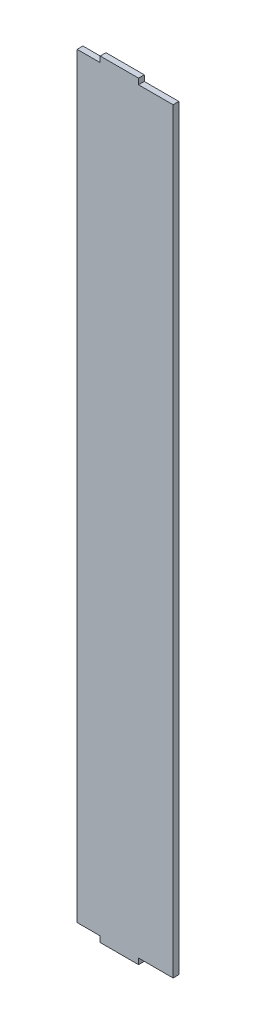
ISO-10303-21;
HEADER;
FILE_DESCRIPTION(('STEP AP214'),'2;1');
FILE_NAME('part.step','',(''),(''),'','','');
FILE_SCHEMA(('AUTOMOTIVE_DESIGN { 1 0 10303 214 1 1 1 1 }'));
ENDSEC;
DATA;
#1=APPLICATION_CONTEXT('core data for automotive mechanical design processes');
#2=APPLICATION_PROTOCOL_DEFINITION('international standard','automotive_design',2000,#1);
#3=PRODUCT_CONTEXT('',#1,'mechanical');
#4=PRODUCT('Part','Part','',(#3));
#5=PRODUCT_RELATED_PRODUCT_CATEGORY('part','',(#4));
#6=PRODUCT_DEFINITION_FORMATION('','',#4);
#7=PRODUCT_DEFINITION_CONTEXT('part definition',#1,'design');
#8=PRODUCT_DEFINITION('design','',#6,#7);
#9=PRODUCT_DEFINITION_SHAPE('','',#8);
#10=(LENGTH_UNIT() NAMED_UNIT(*) SI_UNIT(.MILLI.,.METRE.));
#11=(NAMED_UNIT(*) PLANE_ANGLE_UNIT() SI_UNIT($,.RADIAN.));
#12=(NAMED_UNIT(*) SI_UNIT($,.STERADIAN.) SOLID_ANGLE_UNIT());
#13=UNCERTAINTY_MEASURE_WITH_UNIT(LENGTH_MEASURE(1.E-05),#10,'distance_accuracy_value','');
#14=(GEOMETRIC_REPRESENTATION_CONTEXT(3) GLOBAL_UNCERTAINTY_ASSIGNED_CONTEXT((#13)) GLOBAL_UNIT_ASSIGNED_CONTEXT((#10,
#11,#12)) REPRESENTATION_CONTEXT('',''));
#15=CARTESIAN_POINT('',(0.,0.,0.));
#16=DIRECTION('',(0.,0.,1.));
#17=DIRECTION('',(1.,0.,0.));
#18=AXIS2_PLACEMENT_3D('',#15,#16,#17);
#19=CARTESIAN_POINT('',(32.,0.,3.));
#20=DIRECTION('',(-1.,0.,0.));
#21=DIRECTION('',(0.,0.,1.));
#22=AXIS2_PLACEMENT_3D('',#19,#20,#21);
#23=PLANE('',#22);
#24=DIRECTION('',(0.,1.,0.));
#25=VECTOR('',#24,1.);
#26=CARTESIAN_POINT('',(32.,0.,0.));
#27=LINE('',#26,#25);
#28=CARTESIAN_POINT('',(32.,-3.,0.));
#29=VERTEX_POINT('',#28);
#30=CARTESIAN_POINT('',(32.,0.,0.));
#31=VERTEX_POINT('',#30);
#32=EDGE_CURVE('E156',#29,#31,#27,.T.);
#33=ORIENTED_EDGE('',*,*,#32,.T.);
#34=DIRECTION('',(0.,0.,-1.));
#35=VECTOR('',#34,1.);
#36=CARTESIAN_POINT('',(32.,0.,3.));
#37=LINE('',#36,#35);
#38=CARTESIAN_POINT('',(32.,0.,3.));
#39=VERTEX_POINT('',#38);
#40=EDGE_CURVE('E11',#39,#31,#37,.T.);
#41=ORIENTED_EDGE('',*,*,#40,.F.);
#42=DIRECTION('',(0.,1.,0.));
#43=VECTOR('',#42,1.);
#44=CARTESIAN_POINT('',(32.,0.,3.));
#45=LINE('',#44,#43);
#46=CARTESIAN_POINT('',(32.,-3.,3.));
#47=VERTEX_POINT('',#46);
#48=EDGE_CURVE('E183',#47,#39,#45,.T.);
#49=ORIENTED_EDGE('',*,*,#48,.F.);
#50=DIRECTION('',(0.,0.,-1.));
#51=VECTOR('',#50,1.);
#52=CARTESIAN_POINT('',(32.,-3.,3.));
#53=LINE('',#52,#51);
#54=EDGE_CURVE('E152',#47,#29,#53,.T.);
#55=ORIENTED_EDGE('',*,*,#54,.T.);
#56=EDGE_LOOP('',(#33,#41,#49,#55));
#57=FACE_BOUND('',#56,.T.);
#58=ADVANCED_FACE('F35',(#57),#23,.F.);
#59=CARTESIAN_POINT('',(0.,0.,3.));
#60=DIRECTION('',(0.,1.,0.));
#61=DIRECTION('',(0.,0.,1.));
#62=AXIS2_PLACEMENT_3D('',#59,#60,#61);
#63=PLANE('',#62);
#64=DIRECTION('',(1.,0.,0.));
#65=VECTOR('',#64,1.);
#66=CARTESIAN_POINT('',(0.,0.,0.));
#67=LINE('',#66,#65);
#68=CARTESIAN_POINT('',(50.,0.,0.));
#69=VERTEX_POINT('',#68);
#70=EDGE_CURVE('E159',#31,#69,#67,.T.);
#71=ORIENTED_EDGE('',*,*,#70,.T.);
#72=DIRECTION('',(0.,0.,-1.));
#73=VECTOR('',#72,1.);
#74=CARTESIAN_POINT('',(50.,0.,3.));
#75=LINE('',#74,#73);
#76=CARTESIAN_POINT('',(50.,0.,3.));
#77=VERTEX_POINT('',#76);
#78=EDGE_CURVE('E43',#77,#69,#75,.T.);
#79=ORIENTED_EDGE('',*,*,#78,.F.);
#80=DIRECTION('',(1.,0.,0.));
#81=VECTOR('',#80,1.);
#82=CARTESIAN_POINT('',(0.,0.,3.));
#83=LINE('',#82,#81);
#84=EDGE_CURVE('E106',#39,#77,#83,.T.);
#85=ORIENTED_EDGE('',*,*,#84,.F.);
#86=ORIENTED_EDGE('',*,*,#40,.T.);
#87=EDGE_LOOP('',(#71,#79,#85,#86));
#88=FACE_BOUND('',#87,.T.);
#89=ADVANCED_FACE('F253',(#88),#63,.F.);
#90=CARTESIAN_POINT('',(50.,0.,3.));
#91=DIRECTION('',(-1.,0.,0.));
#92=DIRECTION('',(0.,-1.,0.));
#93=AXIS2_PLACEMENT_3D('',#90,#91,#92);
#94=PLANE('',#93);
#95=DIRECTION('',(0.,1.,0.));
#96=VECTOR('',#95,1.);
#97=CARTESIAN_POINT('',(50.,0.,0.));
#98=LINE('',#97,#96);
#99=CARTESIAN_POINT('',(50.,394.,0.));
#100=VERTEX_POINT('',#99);
#101=EDGE_CURVE('E161',#69,#100,#98,.T.);
#102=ORIENTED_EDGE('',*,*,#101,.T.);
#103=DIRECTION('',(0.,0.,-1.));
#104=VECTOR('',#103,1.);
#105=CARTESIAN_POINT('',(50.,394.,3.));
#106=LINE('',#105,#104);
#107=CARTESIAN_POINT('',(50.,394.,3.));
#108=VERTEX_POINT('',#107);
#109=EDGE_CURVE('E197',#108,#100,#106,.T.);
#110=ORIENTED_EDGE('',*,*,#109,.F.);
#111=DIRECTION('',(0.,1.,0.));
#112=VECTOR('',#111,1.);
#113=CARTESIAN_POINT('',(50.,0.,3.));
#114=LINE('',#113,#112);
#115=EDGE_CURVE('E205',#77,#108,#114,.T.);
#116=ORIENTED_EDGE('',*,*,#115,.F.);
#117=ORIENTED_EDGE('',*,*,#78,.T.);
#118=EDGE_LOOP('',(#102,#110,#116,#117));
#119=FACE_BOUND('',#118,.T.);
#120=ADVANCED_FACE('F203',(#119),#94,.F.);
#121=CARTESIAN_POINT('',(0.,394.,3.));
#122=DIRECTION('',(0.,-1.,0.));
#123=DIRECTION('',(0.,0.,-1.));
#124=AXIS2_PLACEMENT_3D('',#121,#122,#123);
#125=PLANE('',#124);
#126=DIRECTION('',(-1.,0.,0.));
#127=VECTOR('',#126,1.);
#128=CARTESIAN_POINT('',(0.,394.,0.));
#129=LINE('',#128,#127);
#130=CARTESIAN_POINT('',(32.,394.,0.));
#131=VERTEX_POINT('',#130);
#132=EDGE_CURVE('E163',#100,#131,#129,.T.);
#133=ORIENTED_EDGE('',*,*,#132,.T.);
#134=DIRECTION('',(0.,0.,-1.));
#135=VECTOR('',#134,1.);
#136=CARTESIAN_POINT('',(32.,394.,3.));
#137=LINE('',#136,#135);
#138=CARTESIAN_POINT('',(32.,394.,3.));
#139=VERTEX_POINT('',#138);
#140=EDGE_CURVE('E195',#139,#131,#137,.T.);
#141=ORIENTED_EDGE('',*,*,#140,.F.);
#142=DIRECTION('',(-1.,0.,0.));
#143=VECTOR('',#142,1.);
#144=CARTESIAN_POINT('',(0.,394.,3.));
#145=LINE('',#144,#143);
#146=EDGE_CURVE('E216',#108,#139,#145,.T.);
#147=ORIENTED_EDGE('',*,*,#146,.F.);
#148=ORIENTED_EDGE('',*,*,#109,.T.);
#149=EDGE_LOOP('',(#133,#141,#147,#148));
#150=FACE_BOUND('',#149,.T.);
#151=ADVANCED_FACE('F213',(#150),#125,.F.);
#152=CARTESIAN_POINT('',(32.,0.,3.));
#153=DIRECTION('',(1.,0.,0.));
#154=DIRECTION('',(0.,0.,-1.));
#155=AXIS2_PLACEMENT_3D('',#152,#153,#154);
#156=PLANE('',#155);
#157=DIRECTION('',(0.,-1.,0.));
#158=VECTOR('',#157,1.);
#159=CARTESIAN_POINT('',(32.,0.,0.));
#160=LINE('',#159,#158);
#161=CARTESIAN_POINT('',(32.,397.,0.));
#162=VERTEX_POINT('',#161);
#163=EDGE_CURVE('E166',#162,#131,#160,.T.);
#164=ORIENTED_EDGE('',*,*,#163,.F.);
#165=DIRECTION('',(0.,0.,-1.));
#166=VECTOR('',#165,1.);
#167=CARTESIAN_POINT('',(32.,397.,3.));
#168=LINE('',#167,#166);
#169=CARTESIAN_POINT('',(32.,397.,3.));
#170=VERTEX_POINT('',#169);
#171=EDGE_CURVE('E193',#170,#162,#168,.T.);
#172=ORIENTED_EDGE('',*,*,#171,.F.);
#173=DIRECTION('',(0.,-1.,0.));
#174=VECTOR('',#173,1.);
#175=CARTESIAN_POINT('',(32.,0.,3.));
#176=LINE('',#175,#174);
#177=EDGE_CURVE('E218',#170,#139,#176,.T.);
#178=ORIENTED_EDGE('',*,*,#177,.T.);
#179=ORIENTED_EDGE('',*,*,#140,.T.);
#180=EDGE_LOOP('',(#164,#172,#178,#179));
#181=FACE_BOUND('',#180,.T.);
#182=ADVANCED_FACE('F322',(#181),#156,.T.);
#183=CARTESIAN_POINT('',(0.,397.,3.));
#184=DIRECTION('',(0.,1.,0.));
#185=DIRECTION('',(0.,0.,1.));
#186=AXIS2_PLACEMENT_3D('',#183,#184,#185);
#187=PLANE('',#186);
#188=DIRECTION('',(1.,0.,0.));
#189=VECTOR('',#188,1.);
#190=CARTESIAN_POINT('',(0.,397.,0.));
#191=LINE('',#190,#189);
#192=CARTESIAN_POINT('',(12.,397.,0.));
#193=VERTEX_POINT('',#192);
#194=EDGE_CURVE('E169',#193,#162,#191,.T.);
#195=ORIENTED_EDGE('',*,*,#194,.F.);
#196=DIRECTION('',(0.,0.,-1.));
#197=VECTOR('',#196,1.);
#198=CARTESIAN_POINT('',(12.,397.,3.));
#199=LINE('',#198,#197);
#200=CARTESIAN_POINT('',(12.,397.,3.));
#201=VERTEX_POINT('',#200);
#202=EDGE_CURVE('E191',#201,#193,#199,.T.);
#203=ORIENTED_EDGE('',*,*,#202,.F.);
#204=DIRECTION('',(1.,0.,0.));
#205=VECTOR('',#204,1.);
#206=CARTESIAN_POINT('',(0.,397.,3.));
#207=LINE('',#206,#205);
#208=EDGE_CURVE('E220',#201,#170,#207,.T.);
#209=ORIENTED_EDGE('',*,*,#208,.T.);
#210=ORIENTED_EDGE('',*,*,#171,.T.);
#211=EDGE_LOOP('',(#195,#203,#209,#210));
#212=FACE_BOUND('',#211,.T.);
#213=ADVANCED_FACE('F313',(#212),#187,.T.);
#214=CARTESIAN_POINT('',(12.,0.,3.));
#215=DIRECTION('',(-1.,0.,0.));
#216=DIRECTION('',(0.,0.,1.));
#217=AXIS2_PLACEMENT_3D('',#214,#215,#216);
#218=PLANE('',#217);
#219=DIRECTION('',(0.,1.,0.));
#220=VECTOR('',#219,1.);
#221=CARTESIAN_POINT('',(12.,0.,0.));
#222=LINE('',#221,#220);
#223=CARTESIAN_POINT('',(12.,394.,0.));
#224=VERTEX_POINT('',#223);
#225=EDGE_CURVE('E172',#224,#193,#222,.T.);
#226=ORIENTED_EDGE('',*,*,#225,.F.);
#227=DIRECTION('',(0.,0.,-1.));
#228=VECTOR('',#227,1.);
#229=CARTESIAN_POINT('',(12.,394.,3.));
#230=LINE('',#229,#228);
#231=CARTESIAN_POINT('',(12.,394.,3.));
#232=VERTEX_POINT('',#231);
#233=EDGE_CURVE('E189',#232,#224,#230,.T.);
#234=ORIENTED_EDGE('',*,*,#233,.F.);
#235=DIRECTION('',(0.,1.,0.));
#236=VECTOR('',#235,1.);
#237=CARTESIAN_POINT('',(12.,0.,3.));
#238=LINE('',#237,#236);
#239=EDGE_CURVE('E227',#232,#201,#238,.T.);
#240=ORIENTED_EDGE('',*,*,#239,.T.);
#241=ORIENTED_EDGE('',*,*,#202,.T.);
#242=EDGE_LOOP('',(#226,#234,#240,#241));
#243=FACE_BOUND('',#242,.T.);
#244=ADVANCED_FACE('F239',(#243),#218,.T.);
#245=CARTESIAN_POINT('',(0.,394.,3.));
#246=DIRECTION('',(0.,1.,0.));
#247=DIRECTION('',(0.,0.,1.));
#248=AXIS2_PLACEMENT_3D('',#245,#246,#247);
#249=PLANE('',#248);
#250=DIRECTION('',(1.,0.,0.));
#251=VECTOR('',#250,1.);
#252=CARTESIAN_POINT('',(0.,394.,0.));
#253=LINE('',#252,#251);
#254=CARTESIAN_POINT('',(0.,394.,0.));
#255=VERTEX_POINT('',#254);
#256=EDGE_CURVE('E175',#255,#224,#253,.T.);
#257=ORIENTED_EDGE('',*,*,#256,.F.);
#258=DIRECTION('',(0.,0.,-1.));
#259=VECTOR('',#258,1.);
#260=CARTESIAN_POINT('',(0.,394.,3.));
#261=LINE('',#260,#259);
#262=CARTESIAN_POINT('',(0.,394.,3.));
#263=VERTEX_POINT('',#262);
#264=EDGE_CURVE('E187',#263,#255,#261,.T.);
#265=ORIENTED_EDGE('',*,*,#264,.F.);
#266=DIRECTION('',(1.,0.,0.));
#267=VECTOR('',#266,1.);
#268=CARTESIAN_POINT('',(0.,394.,3.));
#269=LINE('',#268,#267);
#270=EDGE_CURVE('E230',#263,#232,#269,.T.);
#271=ORIENTED_EDGE('',*,*,#270,.T.);
#272=ORIENTED_EDGE('',*,*,#233,.T.);
#273=EDGE_LOOP('',(#257,#265,#271,#272));
#274=FACE_BOUND('',#273,.T.);
#275=ADVANCED_FACE('F234',(#274),#249,.T.);
#276=CARTESIAN_POINT('',(0.,0.,3.));
#277=DIRECTION('',(1.,0.,0.));
#278=DIRECTION('',(0.,0.,-1.));
#279=AXIS2_PLACEMENT_3D('',#276,#277,#278);
#280=PLANE('',#279);
#281=DIRECTION('',(0.,-1.,0.));
#282=VECTOR('',#281,1.);
#283=CARTESIAN_POINT('',(0.,0.,0.));
#284=LINE('',#283,#282);
#285=CARTESIAN_POINT('',(0.,0.,0.));
#286=VERTEX_POINT('',#285);
#287=EDGE_CURVE('E178',#255,#286,#284,.T.);
#288=ORIENTED_EDGE('',*,*,#287,.T.);
#289=DIRECTION('',(0.,0.,-1.));
#290=VECTOR('',#289,1.);
#291=CARTESIAN_POINT('',(0.,0.,3.));
#292=LINE('',#291,#290);
#293=CARTESIAN_POINT('',(0.,0.,3.));
#294=VERTEX_POINT('',#293);
#295=EDGE_CURVE('E147',#294,#286,#292,.T.);
#296=ORIENTED_EDGE('',*,*,#295,.F.);
#297=DIRECTION('',(0.,-1.,0.));
#298=VECTOR('',#297,1.);
#299=CARTESIAN_POINT('',(0.,0.,3.));
#300=LINE('',#299,#298);
#301=EDGE_CURVE('E138',#263,#294,#300,.T.);
#302=ORIENTED_EDGE('',*,*,#301,.F.);
#303=ORIENTED_EDGE('',*,*,#264,.T.);
#304=EDGE_LOOP('',(#288,#296,#302,#303));
#305=FACE_BOUND('',#304,.T.);
#306=ADVANCED_FACE('F243',(#305),#280,.F.);
#307=CARTESIAN_POINT('',(0.,0.,3.));
#308=DIRECTION('',(0.,1.,0.));
#309=DIRECTION('',(0.,0.,1.));
#310=AXIS2_PLACEMENT_3D('',#307,#308,#309);
#311=PLANE('',#310);
#312=DIRECTION('',(1.,0.,0.));
#313=VECTOR('',#312,1.);
#314=CARTESIAN_POINT('',(0.,0.,0.));
#315=LINE('',#314,#313);
#316=CARTESIAN_POINT('',(12.,0.,0.));
#317=VERTEX_POINT('',#316);
#318=EDGE_CURVE('E146',#286,#317,#315,.T.);
#319=ORIENTED_EDGE('',*,*,#318,.T.);
#320=DIRECTION('',(0.,0.,-1.));
#321=VECTOR('',#320,1.);
#322=CARTESIAN_POINT('',(12.,0.,3.));
#323=LINE('',#322,#321);
#324=CARTESIAN_POINT('',(12.,0.,3.));
#325=VERTEX_POINT('',#324);
#326=EDGE_CURVE('E143',#325,#317,#323,.T.);
#327=ORIENTED_EDGE('',*,*,#326,.F.);
#328=DIRECTION('',(1.,0.,0.));
#329=VECTOR('',#328,1.);
#330=CARTESIAN_POINT('',(0.,0.,3.));
#331=LINE('',#330,#329);
#332=EDGE_CURVE('E131',#294,#325,#331,.T.);
#333=ORIENTED_EDGE('',*,*,#332,.F.);
#334=ORIENTED_EDGE('',*,*,#295,.T.);
#335=EDGE_LOOP('',(#319,#327,#333,#334));
#336=FACE_BOUND('',#335,.T.);
#337=ADVANCED_FACE('F144',(#336),#311,.F.);
#338=CARTESIAN_POINT('',(12.,0.,3.));
#339=DIRECTION('',(1.,0.,0.));
#340=DIRECTION('',(0.,1.,0.));
#341=AXIS2_PLACEMENT_3D('',#338,#339,#340);
#342=PLANE('',#341);
#343=DIRECTION('',(0.,-1.,0.));
#344=VECTOR('',#343,1.);
#345=CARTESIAN_POINT('',(12.,0.,0.));
#346=LINE('',#345,#344);
#347=CARTESIAN_POINT('',(12.,-3.,0.));
#348=VERTEX_POINT('',#347);
#349=EDGE_CURVE('E92',#317,#348,#346,.T.);
#350=ORIENTED_EDGE('',*,*,#349,.T.);
#351=DIRECTION('',(0.,0.,-1.));
#352=VECTOR('',#351,1.);
#353=CARTESIAN_POINT('',(12.,-3.,3.));
#354=LINE('',#353,#352);
#355=CARTESIAN_POINT('',(12.,-3.,3.));
#356=VERTEX_POINT('',#355);
#357=EDGE_CURVE('E148',#356,#348,#354,.T.);
#358=ORIENTED_EDGE('',*,*,#357,.F.);
#359=DIRECTION('',(0.,-1.,0.));
#360=VECTOR('',#359,1.);
#361=CARTESIAN_POINT('',(12.,0.,3.));
#362=LINE('',#361,#360);
#363=EDGE_CURVE('E135',#325,#356,#362,.T.);
#364=ORIENTED_EDGE('',*,*,#363,.F.);
#365=ORIENTED_EDGE('',*,*,#326,.T.);
#366=EDGE_LOOP('',(#350,#358,#364,#365));
#367=FACE_BOUND('',#366,.T.);
#368=ADVANCED_FACE('F150',(#367),#342,.F.);
#369=CARTESIAN_POINT('',(0.,-3.,3.));
#370=DIRECTION('',(0.,1.,0.));
#371=DIRECTION('',(0.,0.,1.));
#372=AXIS2_PLACEMENT_3D('',#369,#370,#371);
#373=PLANE('',#372);
#374=DIRECTION('',(1.,0.,0.));
#375=VECTOR('',#374,1.);
#376=CARTESIAN_POINT('',(0.,-3.,0.));
#377=LINE('',#376,#375);
#378=EDGE_CURVE('E98',#348,#29,#377,.T.);
#379=ORIENTED_EDGE('',*,*,#378,.T.);
#380=ORIENTED_EDGE('',*,*,#54,.F.);
#381=DIRECTION('',(1.,0.,0.));
#382=VECTOR('',#381,1.);
#383=CARTESIAN_POINT('',(0.,-3.,3.));
#384=LINE('',#383,#382);
#385=EDGE_CURVE('E51',#356,#47,#384,.T.);
#386=ORIENTED_EDGE('',*,*,#385,.F.);
#387=ORIENTED_EDGE('',*,*,#357,.T.);
#388=EDGE_LOOP('',(#379,#380,#386,#387));
#389=FACE_BOUND('',#388,.T.);
#390=ADVANCED_FACE('F260',(#389),#373,.F.);
#391=CARTESIAN_POINT('',(0.,0.,3.));
#392=DIRECTION('',(0.,0.,1.));
#393=DIRECTION('',(1.,0.,0.));
#394=AXIS2_PLACEMENT_3D('',#391,#392,#393);
#395=PLANE('',#394);
#396=ORIENTED_EDGE('',*,*,#48,.T.);
#397=ORIENTED_EDGE('',*,*,#84,.T.);
#398=ORIENTED_EDGE('',*,*,#115,.T.);
#399=ORIENTED_EDGE('',*,*,#146,.T.);
#400=ORIENTED_EDGE('',*,*,#177,.F.);
#401=ORIENTED_EDGE('',*,*,#208,.F.);
#402=ORIENTED_EDGE('',*,*,#239,.F.);
#403=ORIENTED_EDGE('',*,*,#270,.F.);
#404=ORIENTED_EDGE('',*,*,#301,.T.);
#405=ORIENTED_EDGE('',*,*,#332,.T.);
#406=ORIENTED_EDGE('',*,*,#363,.T.);
#407=ORIENTED_EDGE('',*,*,#385,.T.);
#408=EDGE_LOOP('',(#396,#397,#398,#399,#400,#401,#402,#403,#404,#405,#406,#407));
#409=FACE_BOUND('',#408,.T.);
#410=ADVANCED_FACE('F133',(#409),#395,.T.);
#411=CARTESIAN_POINT('',(0.,0.,0.));
#412=DIRECTION('',(0.,0.,1.));
#413=DIRECTION('',(1.,0.,0.));
#414=AXIS2_PLACEMENT_3D('',#411,#412,#413);
#415=PLANE('',#414);
#416=ORIENTED_EDGE('',*,*,#32,.F.);
#417=ORIENTED_EDGE('',*,*,#378,.F.);
#418=ORIENTED_EDGE('',*,*,#349,.F.);
#419=ORIENTED_EDGE('',*,*,#318,.F.);
#420=ORIENTED_EDGE('',*,*,#287,.F.);
#421=ORIENTED_EDGE('',*,*,#256,.T.);
#422=ORIENTED_EDGE('',*,*,#225,.T.);
#423=ORIENTED_EDGE('',*,*,#194,.T.);
#424=ORIENTED_EDGE('',*,*,#163,.T.);
#425=ORIENTED_EDGE('',*,*,#132,.F.);
#426=ORIENTED_EDGE('',*,*,#101,.F.);
#427=ORIENTED_EDGE('',*,*,#70,.F.);
#428=EDGE_LOOP('',(#416,#417,#418,#419,#420,#421,#422,#423,#424,#425,#426,#427));
#429=FACE_BOUND('',#428,.T.);
#430=ADVANCED_FACE('F209',(#429),#415,.F.);
#431=CLOSED_SHELL('',(#58,#89,#120,#151,#182,#213,#244,#275,#306,#337,#368,#390,#410,#430));
#432=MANIFOLD_SOLID_BREP('B2',#431);
#433=ADVANCED_BREP_SHAPE_REPRESENTATION('',(#18,#432),#14);
#434=SHAPE_DEFINITION_REPRESENTATION(#9,#433);
ENDSEC;
END-ISO-10303-21;
